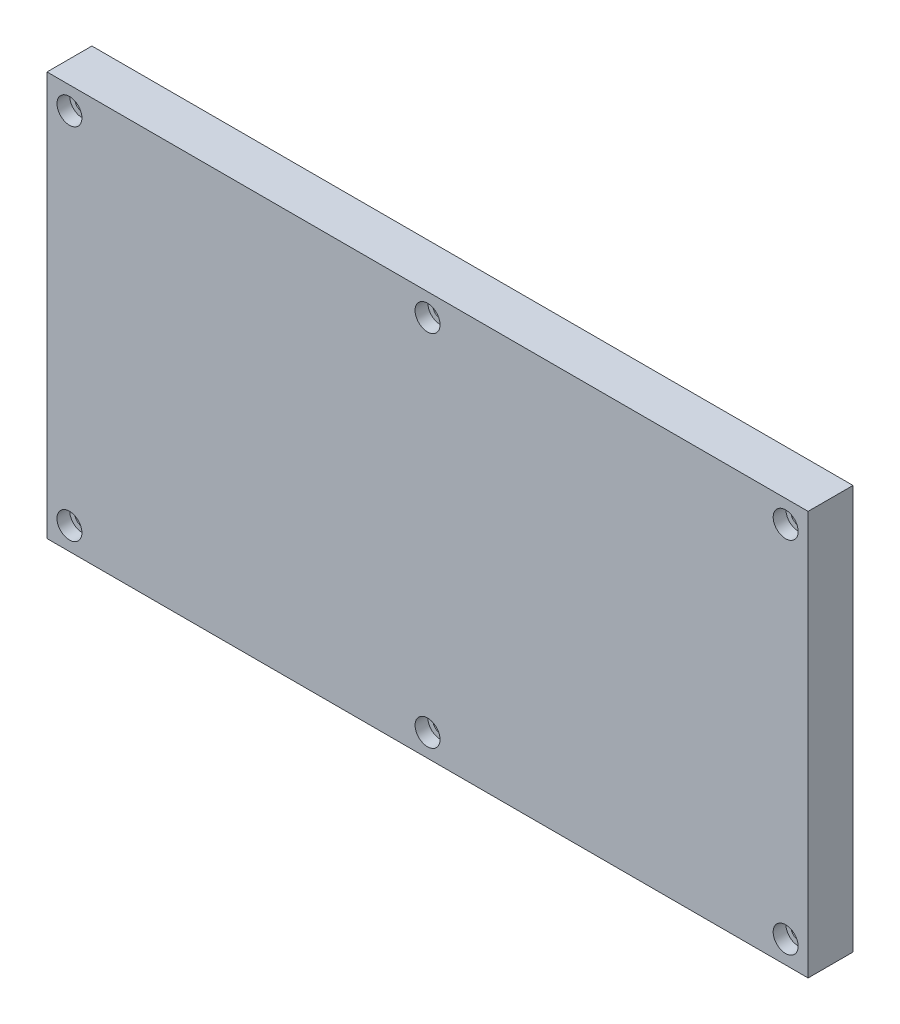
ISO-10303-21;
HEADER;
FILE_DESCRIPTION(('STEP AP214'),'2;1');
FILE_NAME('part.step','',(''),(''),'','','');
FILE_SCHEMA(('AUTOMOTIVE_DESIGN { 1 0 10303 214 1 1 1 1 }'));
ENDSEC;
DATA;
#1=APPLICATION_CONTEXT('core data for automotive mechanical design processes');
#2=APPLICATION_PROTOCOL_DEFINITION('international standard','automotive_design',2000,#1);
#3=PRODUCT_CONTEXT('',#1,'mechanical');
#4=PRODUCT('Part','Part','',(#3));
#5=PRODUCT_RELATED_PRODUCT_CATEGORY('part','',(#4));
#6=PRODUCT_DEFINITION_FORMATION('','',#4);
#7=PRODUCT_DEFINITION_CONTEXT('part definition',#1,'design');
#8=PRODUCT_DEFINITION('design','',#6,#7);
#9=PRODUCT_DEFINITION_SHAPE('','',#8);
#10=(LENGTH_UNIT() NAMED_UNIT(*) SI_UNIT(.MILLI.,.METRE.));
#11=(NAMED_UNIT(*) PLANE_ANGLE_UNIT() SI_UNIT($,.RADIAN.));
#12=(NAMED_UNIT(*) SI_UNIT($,.STERADIAN.) SOLID_ANGLE_UNIT());
#13=UNCERTAINTY_MEASURE_WITH_UNIT(LENGTH_MEASURE(1.E-05),#10,'distance_accuracy_value','');
#14=(GEOMETRIC_REPRESENTATION_CONTEXT(3) GLOBAL_UNCERTAINTY_ASSIGNED_CONTEXT((#13)) GLOBAL_UNIT_ASSIGNED_CONTEXT((#10,
#11,#12)) REPRESENTATION_CONTEXT('',''));
#15=CARTESIAN_POINT('',(0.,0.,0.));
#16=DIRECTION('',(0.,0.,1.));
#17=DIRECTION('',(1.,0.,0.));
#18=AXIS2_PLACEMENT_3D('',#15,#16,#17);
#19=CARTESIAN_POINT('',(0.,0.,10.));
#20=DIRECTION('',(1.,0.,0.));
#21=DIRECTION('',(0.,0.,-1.));
#22=AXIS2_PLACEMENT_3D('',#19,#20,#21);
#23=PLANE('',#22);
#24=DIRECTION('',(0.,-1.,0.));
#25=VECTOR('',#24,1.);
#26=CARTESIAN_POINT('',(0.,0.,0.));
#27=LINE('',#26,#25);
#28=CARTESIAN_POINT('',(0.,90.,0.));
#29=VERTEX_POINT('',#28);
#30=CARTESIAN_POINT('',(0.,0.,0.));
#31=VERTEX_POINT('',#30);
#32=EDGE_CURVE('E95',#29,#31,#27,.T.);
#33=ORIENTED_EDGE('',*,*,#32,.T.);
#34=DIRECTION('',(0.,0.,-1.));
#35=VECTOR('',#34,1.);
#36=CARTESIAN_POINT('',(0.,0.,10.));
#37=LINE('',#36,#35);
#38=CARTESIAN_POINT('',(0.,0.,10.));
#39=VERTEX_POINT('',#38);
#40=EDGE_CURVE('E11',#39,#31,#37,.T.);
#41=ORIENTED_EDGE('',*,*,#40,.F.);
#42=DIRECTION('',(0.,-1.,0.));
#43=VECTOR('',#42,1.);
#44=CARTESIAN_POINT('',(0.,0.,10.));
#45=LINE('',#44,#43);
#46=CARTESIAN_POINT('',(0.,90.,10.));
#47=VERTEX_POINT('',#46);
#48=EDGE_CURVE('E83',#47,#39,#45,.T.);
#49=ORIENTED_EDGE('',*,*,#48,.F.);
#50=DIRECTION('',(0.,0.,-1.));
#51=VECTOR('',#50,1.);
#52=CARTESIAN_POINT('',(0.,90.,10.));
#53=LINE('',#52,#51);
#54=EDGE_CURVE('E91',#47,#29,#53,.T.);
#55=ORIENTED_EDGE('',*,*,#54,.T.);
#56=EDGE_LOOP('',(#33,#41,#49,#55));
#57=FACE_BOUND('',#56,.T.);
#58=ADVANCED_FACE('F32',(#57),#23,.F.);
#59=CARTESIAN_POINT('',(0.,0.,10.));
#60=DIRECTION('',(0.,1.,0.));
#61=DIRECTION('',(0.,0.,1.));
#62=AXIS2_PLACEMENT_3D('',#59,#60,#61);
#63=PLANE('',#62);
#64=DIRECTION('',(1.,0.,0.));
#65=VECTOR('',#64,1.);
#66=CARTESIAN_POINT('',(0.,0.,0.));
#67=LINE('',#66,#65);
#68=CARTESIAN_POINT('',(169.5,0.,0.));
#69=VERTEX_POINT('',#68);
#70=EDGE_CURVE('E87',#31,#69,#67,.T.);
#71=ORIENTED_EDGE('',*,*,#70,.T.);
#72=DIRECTION('',(0.,0.,-1.));
#73=VECTOR('',#72,1.);
#74=CARTESIAN_POINT('',(169.5,0.,10.));
#75=LINE('',#74,#73);
#76=CARTESIAN_POINT('',(169.5,0.,10.));
#77=VERTEX_POINT('',#76);
#78=EDGE_CURVE('E40',#77,#69,#75,.T.);
#79=ORIENTED_EDGE('',*,*,#78,.F.);
#80=DIRECTION('',(1.,0.,0.));
#81=VECTOR('',#80,1.);
#82=CARTESIAN_POINT('',(0.,0.,10.));
#83=LINE('',#82,#81);
#84=EDGE_CURVE('E78',#39,#77,#83,.T.);
#85=ORIENTED_EDGE('',*,*,#84,.F.);
#86=ORIENTED_EDGE('',*,*,#40,.T.);
#87=EDGE_LOOP('',(#71,#79,#85,#86));
#88=FACE_BOUND('',#87,.T.);
#89=ADVANCED_FACE('F86',(#88),#63,.F.);
#90=CARTESIAN_POINT('',(169.5,0.,10.));
#91=DIRECTION('',(-1.,0.,0.));
#92=DIRECTION('',(0.,0.,1.));
#93=AXIS2_PLACEMENT_3D('',#90,#91,#92);
#94=PLANE('',#93);
#95=DIRECTION('',(0.,1.,0.));
#96=VECTOR('',#95,1.);
#97=CARTESIAN_POINT('',(169.5,0.,0.));
#98=LINE('',#97,#96);
#99=CARTESIAN_POINT('',(169.5,90.,0.));
#100=VERTEX_POINT('',#99);
#101=EDGE_CURVE('E65',#69,#100,#98,.T.);
#102=ORIENTED_EDGE('',*,*,#101,.T.);
#103=DIRECTION('',(0.,0.,-1.));
#104=VECTOR('',#103,1.);
#105=CARTESIAN_POINT('',(169.5,90.,10.));
#106=LINE('',#105,#104);
#107=CARTESIAN_POINT('',(169.5,90.,10.));
#108=VERTEX_POINT('',#107);
#109=EDGE_CURVE('E88',#108,#100,#106,.T.);
#110=ORIENTED_EDGE('',*,*,#109,.F.);
#111=DIRECTION('',(0.,1.,0.));
#112=VECTOR('',#111,1.);
#113=CARTESIAN_POINT('',(169.5,0.,10.));
#114=LINE('',#113,#112);
#115=EDGE_CURVE('E81',#77,#108,#114,.T.);
#116=ORIENTED_EDGE('',*,*,#115,.F.);
#117=ORIENTED_EDGE('',*,*,#78,.T.);
#118=EDGE_LOOP('',(#102,#110,#116,#117));
#119=FACE_BOUND('',#118,.T.);
#120=ADVANCED_FACE('F89',(#119),#94,.F.);
#121=CARTESIAN_POINT('',(0.,90.,10.));
#122=DIRECTION('',(0.,-1.,0.));
#123=DIRECTION('',(0.,0.,-1.));
#124=AXIS2_PLACEMENT_3D('',#121,#122,#123);
#125=PLANE('',#124);
#126=DIRECTION('',(-1.,0.,0.));
#127=VECTOR('',#126,1.);
#128=CARTESIAN_POINT('',(0.,90.,0.));
#129=LINE('',#128,#127);
#130=EDGE_CURVE('E71',#100,#29,#129,.T.);
#131=ORIENTED_EDGE('',*,*,#130,.T.);
#132=ORIENTED_EDGE('',*,*,#54,.F.);
#133=DIRECTION('',(-1.,0.,0.));
#134=VECTOR('',#133,1.);
#135=CARTESIAN_POINT('',(0.,90.,10.));
#136=LINE('',#135,#134);
#137=EDGE_CURVE('E48',#108,#47,#136,.T.);
#138=ORIENTED_EDGE('',*,*,#137,.F.);
#139=ORIENTED_EDGE('',*,*,#109,.T.);
#140=EDGE_LOOP('',(#131,#132,#138,#139));
#141=FACE_BOUND('',#140,.T.);
#142=ADVANCED_FACE('F103',(#141),#125,.F.);
#143=CARTESIAN_POINT('',(0.,0.,10.));
#144=DIRECTION('',(0.,0.,-1.));
#145=DIRECTION('',(-1.,0.,0.));
#146=AXIS2_PLACEMENT_3D('',#143,#144,#145);
#147=PLANE('',#146);
#148=CARTESIAN_POINT('',(5.,85.,10.));
#149=DIRECTION('',(0.,0.,1.));
#150=DIRECTION('',(1.,0.,0.));
#151=AXIS2_PLACEMENT_3D('',#148,#149,#150);
#152=CIRCLE('',#151,2.77876);
#153=CARTESIAN_POINT('',(7.77876,85.,10.));
#154=VERTEX_POINT('',#153);
#155=EDGE_CURVE('E177',#154,#154,#152,.T.);
#156=ORIENTED_EDGE('',*,*,#155,.F.);
#157=EDGE_LOOP('',(#156));
#158=FACE_BOUND('',#157,.T.);
#159=CARTESIAN_POINT('',(164.5,85.,10.));
#160=DIRECTION('',(0.,0.,1.));
#161=DIRECTION('',(1.,0.,0.));
#162=AXIS2_PLACEMENT_3D('',#159,#160,#161);
#163=CIRCLE('',#162,2.77875999999999);
#164=CARTESIAN_POINT('',(167.27876,85.,10.));
#165=VERTEX_POINT('',#164);
#166=EDGE_CURVE('E165',#165,#165,#163,.T.);
#167=ORIENTED_EDGE('',*,*,#166,.F.);
#168=EDGE_LOOP('',(#167));
#169=FACE_BOUND('',#168,.T.);
#170=CARTESIAN_POINT('',(164.5,5.,10.));
#171=DIRECTION('',(0.,0.,1.));
#172=DIRECTION('',(1.,0.,0.));
#173=AXIS2_PLACEMENT_3D('',#170,#171,#172);
#174=CIRCLE('',#173,2.77875999999999);
#175=CARTESIAN_POINT('',(167.27876,5.,10.));
#176=VERTEX_POINT('',#175);
#177=EDGE_CURVE('E153',#176,#176,#174,.T.);
#178=ORIENTED_EDGE('',*,*,#177,.F.);
#179=EDGE_LOOP('',(#178));
#180=FACE_BOUND('',#179,.T.);
#181=CARTESIAN_POINT('',(5.,5.,10.));
#182=DIRECTION('',(0.,0.,1.));
#183=DIRECTION('',(1.,0.,0.));
#184=AXIS2_PLACEMENT_3D('',#181,#182,#183);
#185=CIRCLE('',#184,2.77876);
#186=CARTESIAN_POINT('',(7.77876,5.,10.));
#187=VERTEX_POINT('',#186);
#188=EDGE_CURVE('E141',#187,#187,#185,.T.);
#189=ORIENTED_EDGE('',*,*,#188,.F.);
#190=EDGE_LOOP('',(#189));
#191=FACE_BOUND('',#190,.T.);
#192=CARTESIAN_POINT('',(84.75,5.,10.));
#193=DIRECTION('',(0.,0.,1.));
#194=DIRECTION('',(1.,0.,0.));
#195=AXIS2_PLACEMENT_3D('',#192,#193,#194);
#196=CIRCLE('',#195,2.77876000000001);
#197=CARTESIAN_POINT('',(87.52876,5.,10.));
#198=VERTEX_POINT('',#197);
#199=EDGE_CURVE('E129',#198,#198,#196,.T.);
#200=ORIENTED_EDGE('',*,*,#199,.F.);
#201=EDGE_LOOP('',(#200));
#202=FACE_BOUND('',#201,.T.);
#203=CARTESIAN_POINT('',(84.75,85.,10.));
#204=DIRECTION('',(0.,0.,1.));
#205=DIRECTION('',(1.,0.,0.));
#206=AXIS2_PLACEMENT_3D('',#203,#204,#205);
#207=CIRCLE('',#206,2.77876000000001);
#208=CARTESIAN_POINT('',(87.52876,85.,10.));
#209=VERTEX_POINT('',#208);
#210=EDGE_CURVE('E117',#209,#209,#207,.T.);
#211=ORIENTED_EDGE('',*,*,#210,.F.);
#212=EDGE_LOOP('',(#211));
#213=FACE_BOUND('',#212,.T.);
#214=ORIENTED_EDGE('',*,*,#48,.T.);
#215=ORIENTED_EDGE('',*,*,#84,.T.);
#216=ORIENTED_EDGE('',*,*,#115,.T.);
#217=ORIENTED_EDGE('',*,*,#137,.T.);
#218=EDGE_LOOP('',(#214,#215,#216,#217));
#219=FACE_BOUND('',#218,.T.);
#220=ADVANCED_FACE('F79',(#158,#169,#180,#191,#202,#213,#219),#147,.F.);
#221=CARTESIAN_POINT('',(0.,0.,0.));
#222=DIRECTION('',(0.,0.,-1.));
#223=DIRECTION('',(-1.,0.,0.));
#224=AXIS2_PLACEMENT_3D('',#221,#222,#223);
#225=PLANE('',#224);
#226=CARTESIAN_POINT('',(5.,85.,0.));
#227=DIRECTION('',(0.,0.,1.));
#228=DIRECTION('',(1.,0.,0.));
#229=AXIS2_PLACEMENT_3D('',#226,#227,#228);
#230=CIRCLE('',#229,1.63195);
#231=CARTESIAN_POINT('',(6.63195,85.,0.));
#232=VERTEX_POINT('',#231);
#233=EDGE_CURVE('E168',#232,#232,#230,.T.);
#234=ORIENTED_EDGE('',*,*,#233,.T.);
#235=EDGE_LOOP('',(#234));
#236=FACE_BOUND('',#235,.T.);
#237=CARTESIAN_POINT('',(164.5,85.,0.));
#238=DIRECTION('',(0.,0.,1.));
#239=DIRECTION('',(1.,0.,0.));
#240=AXIS2_PLACEMENT_3D('',#237,#238,#239);
#241=CIRCLE('',#240,1.63194999999999);
#242=CARTESIAN_POINT('',(166.13195,85.,0.));
#243=VERTEX_POINT('',#242);
#244=EDGE_CURVE('E156',#243,#243,#241,.T.);
#245=ORIENTED_EDGE('',*,*,#244,.T.);
#246=EDGE_LOOP('',(#245));
#247=FACE_BOUND('',#246,.T.);
#248=CARTESIAN_POINT('',(164.5,5.,0.));
#249=DIRECTION('',(0.,0.,1.));
#250=DIRECTION('',(1.,0.,0.));
#251=AXIS2_PLACEMENT_3D('',#248,#249,#250);
#252=CIRCLE('',#251,1.63194999999999);
#253=CARTESIAN_POINT('',(166.13195,5.,0.));
#254=VERTEX_POINT('',#253);
#255=EDGE_CURVE('E144',#254,#254,#252,.T.);
#256=ORIENTED_EDGE('',*,*,#255,.T.);
#257=EDGE_LOOP('',(#256));
#258=FACE_BOUND('',#257,.T.);
#259=CARTESIAN_POINT('',(5.,5.,0.));
#260=DIRECTION('',(0.,0.,1.));
#261=DIRECTION('',(1.,0.,0.));
#262=AXIS2_PLACEMENT_3D('',#259,#260,#261);
#263=CIRCLE('',#262,1.63195);
#264=CARTESIAN_POINT('',(6.63195,5.,0.));
#265=VERTEX_POINT('',#264);
#266=EDGE_CURVE('E132',#265,#265,#263,.T.);
#267=ORIENTED_EDGE('',*,*,#266,.T.);
#268=EDGE_LOOP('',(#267));
#269=FACE_BOUND('',#268,.T.);
#270=CARTESIAN_POINT('',(84.75,5.,0.));
#271=DIRECTION('',(0.,0.,1.));
#272=DIRECTION('',(1.,0.,0.));
#273=AXIS2_PLACEMENT_3D('',#270,#271,#272);
#274=CIRCLE('',#273,1.63194999999999);
#275=CARTESIAN_POINT('',(86.38195,5.,0.));
#276=VERTEX_POINT('',#275);
#277=EDGE_CURVE('E120',#276,#276,#274,.T.);
#278=ORIENTED_EDGE('',*,*,#277,.T.);
#279=EDGE_LOOP('',(#278));
#280=FACE_BOUND('',#279,.T.);
#281=CARTESIAN_POINT('',(84.75,85.,0.));
#282=DIRECTION('',(0.,0.,1.));
#283=DIRECTION('',(1.,0.,0.));
#284=AXIS2_PLACEMENT_3D('',#281,#282,#283);
#285=CIRCLE('',#284,1.63194999999999);
#286=CARTESIAN_POINT('',(86.38195,85.,0.));
#287=VERTEX_POINT('',#286);
#288=EDGE_CURVE('E98',#287,#287,#285,.T.);
#289=ORIENTED_EDGE('',*,*,#288,.T.);
#290=EDGE_LOOP('',(#289));
#291=FACE_BOUND('',#290,.T.);
#292=ORIENTED_EDGE('',*,*,#32,.F.);
#293=ORIENTED_EDGE('',*,*,#130,.F.);
#294=ORIENTED_EDGE('',*,*,#101,.F.);
#295=ORIENTED_EDGE('',*,*,#70,.F.);
#296=EDGE_LOOP('',(#292,#293,#294,#295));
#297=FACE_BOUND('',#296,.T.);
#298=ADVANCED_FACE('F106',(#236,#247,#258,#269,#280,#291,#297),#225,.T.);
#299=CARTESIAN_POINT('',(84.75,85.,10.));
#300=DIRECTION('',(0.,0.,1.));
#301=DIRECTION('',(1.,0.,0.));
#302=AXIS2_PLACEMENT_3D('',#299,#300,#301);
#303=CYLINDRICAL_SURFACE('',#302,1.63195);
#304=ORIENTED_EDGE('',*,*,#288,.F.);
#305=EDGE_LOOP('',(#304));
#306=FACE_BOUND('',#305,.T.);
#307=CARTESIAN_POINT('',(84.75,85.,7.1552));
#308=DIRECTION('',(0.,0.,1.));
#309=DIRECTION('',(1.,0.,0.));
#310=AXIS2_PLACEMENT_3D('',#307,#308,#309);
#311=CIRCLE('',#310,1.63195000000001);
#312=CARTESIAN_POINT('',(86.38195,85.,7.1552));
#313=VERTEX_POINT('',#312);
#314=EDGE_CURVE('E111',#313,#313,#311,.T.);
#315=ORIENTED_EDGE('',*,*,#314,.T.);
#316=EDGE_LOOP('',(#315));
#317=FACE_BOUND('',#316,.T.);
#318=ADVANCED_FACE('F209',(#306,#317),#303,.F.);
#319=CARTESIAN_POINT('',(86.38195,85.,7.1552));
#320=DIRECTION('',(0.,0.,-1.));
#321=DIRECTION('',(-1.,0.,0.));
#322=AXIS2_PLACEMENT_3D('',#319,#320,#321);
#323=PLANE('',#322);
#324=ORIENTED_EDGE('',*,*,#314,.F.);
#325=EDGE_LOOP('',(#324));
#326=FACE_BOUND('',#325,.T.);
#327=CARTESIAN_POINT('',(84.75,85.,7.1552));
#328=DIRECTION('',(0.,0.,1.));
#329=DIRECTION('',(1.,0.,0.));
#330=AXIS2_PLACEMENT_3D('',#327,#328,#329);
#331=CIRCLE('',#330,2.77876000000001);
#332=CARTESIAN_POINT('',(87.52876,85.,7.1552));
#333=VERTEX_POINT('',#332);
#334=EDGE_CURVE('E114',#333,#333,#331,.T.);
#335=ORIENTED_EDGE('',*,*,#334,.T.);
#336=EDGE_LOOP('',(#335));
#337=FACE_BOUND('',#336,.T.);
#338=ADVANCED_FACE('F199',(#326,#337),#323,.F.);
#339=CARTESIAN_POINT('',(84.75,85.,10.));
#340=DIRECTION('',(0.,0.,1.));
#341=DIRECTION('',(1.,0.,0.));
#342=AXIS2_PLACEMENT_3D('',#339,#340,#341);
#343=CYLINDRICAL_SURFACE('',#342,2.77876000000001);
#344=ORIENTED_EDGE('',*,*,#334,.F.);
#345=EDGE_LOOP('',(#344));
#346=FACE_BOUND('',#345,.T.);
#347=ORIENTED_EDGE('',*,*,#210,.T.);
#348=EDGE_LOOP('',(#347));
#349=FACE_BOUND('',#348,.T.);
#350=ADVANCED_FACE('F196',(#346,#349),#343,.F.);
#351=CARTESIAN_POINT('',(84.75,5.,10.));
#352=DIRECTION('',(0.,0.,1.));
#353=DIRECTION('',(1.,0.,0.));
#354=AXIS2_PLACEMENT_3D('',#351,#352,#353);
#355=CYLINDRICAL_SURFACE('',#354,1.63195);
#356=ORIENTED_EDGE('',*,*,#277,.F.);
#357=EDGE_LOOP('',(#356));
#358=FACE_BOUND('',#357,.T.);
#359=CARTESIAN_POINT('',(84.75,5.,7.1552));
#360=DIRECTION('',(0.,0.,1.));
#361=DIRECTION('',(1.,0.,0.));
#362=AXIS2_PLACEMENT_3D('',#359,#360,#361);
#363=CIRCLE('',#362,1.63195000000001);
#364=CARTESIAN_POINT('',(86.38195,5.,7.1552));
#365=VERTEX_POINT('',#364);
#366=EDGE_CURVE('E123',#365,#365,#363,.T.);
#367=ORIENTED_EDGE('',*,*,#366,.T.);
#368=EDGE_LOOP('',(#367));
#369=FACE_BOUND('',#368,.T.);
#370=ADVANCED_FACE('F198',(#358,#369),#355,.F.);
#371=CARTESIAN_POINT('',(86.38195,5.,7.1552));
#372=DIRECTION('',(0.,0.,-1.));
#373=DIRECTION('',(-1.,0.,0.));
#374=AXIS2_PLACEMENT_3D('',#371,#372,#373);
#375=PLANE('',#374);
#376=ORIENTED_EDGE('',*,*,#366,.F.);
#377=EDGE_LOOP('',(#376));
#378=FACE_BOUND('',#377,.T.);
#379=CARTESIAN_POINT('',(84.75,5.,7.1552));
#380=DIRECTION('',(0.,0.,1.));
#381=DIRECTION('',(1.,0.,0.));
#382=AXIS2_PLACEMENT_3D('',#379,#380,#381);
#383=CIRCLE('',#382,2.77876000000001);
#384=CARTESIAN_POINT('',(87.52876,5.,7.1552));
#385=VERTEX_POINT('',#384);
#386=EDGE_CURVE('E126',#385,#385,#383,.T.);
#387=ORIENTED_EDGE('',*,*,#386,.T.);
#388=EDGE_LOOP('',(#387));
#389=FACE_BOUND('',#388,.T.);
#390=ADVANCED_FACE('F206',(#378,#389),#375,.F.);
#391=CARTESIAN_POINT('',(84.75,5.,10.));
#392=DIRECTION('',(0.,0.,1.));
#393=DIRECTION('',(1.,0.,0.));
#394=AXIS2_PLACEMENT_3D('',#391,#392,#393);
#395=CYLINDRICAL_SURFACE('',#394,2.77876000000001);
#396=ORIENTED_EDGE('',*,*,#386,.F.);
#397=EDGE_LOOP('',(#396));
#398=FACE_BOUND('',#397,.T.);
#399=ORIENTED_EDGE('',*,*,#199,.T.);
#400=EDGE_LOOP('',(#399));
#401=FACE_BOUND('',#400,.T.);
#402=ADVANCED_FACE('F261',(#398,#401),#395,.F.);
#403=CARTESIAN_POINT('',(5.,5.,10.));
#404=DIRECTION('',(0.,0.,1.));
#405=DIRECTION('',(1.,0.,0.));
#406=AXIS2_PLACEMENT_3D('',#403,#404,#405);
#407=CYLINDRICAL_SURFACE('',#406,1.63195);
#408=ORIENTED_EDGE('',*,*,#266,.F.);
#409=EDGE_LOOP('',(#408));
#410=FACE_BOUND('',#409,.T.);
#411=CARTESIAN_POINT('',(5.,5.,7.1552));
#412=DIRECTION('',(0.,0.,1.));
#413=DIRECTION('',(1.,0.,0.));
#414=AXIS2_PLACEMENT_3D('',#411,#412,#413);
#415=CIRCLE('',#414,1.63195);
#416=CARTESIAN_POINT('',(6.63195,5.,7.1552));
#417=VERTEX_POINT('',#416);
#418=EDGE_CURVE('E135',#417,#417,#415,.T.);
#419=ORIENTED_EDGE('',*,*,#418,.T.);
#420=EDGE_LOOP('',(#419));
#421=FACE_BOUND('',#420,.T.);
#422=ADVANCED_FACE('F271',(#410,#421),#407,.F.);
#423=CARTESIAN_POINT('',(6.63195,5.,7.1552));
#424=DIRECTION('',(0.,0.,-1.));
#425=DIRECTION('',(-1.,0.,0.));
#426=AXIS2_PLACEMENT_3D('',#423,#424,#425);
#427=PLANE('',#426);
#428=ORIENTED_EDGE('',*,*,#418,.F.);
#429=EDGE_LOOP('',(#428));
#430=FACE_BOUND('',#429,.T.);
#431=CARTESIAN_POINT('',(5.,5.,7.1552));
#432=DIRECTION('',(0.,0.,1.));
#433=DIRECTION('',(1.,0.,0.));
#434=AXIS2_PLACEMENT_3D('',#431,#432,#433);
#435=CIRCLE('',#434,2.77876);
#436=CARTESIAN_POINT('',(7.77876,5.,7.1552));
#437=VERTEX_POINT('',#436);
#438=EDGE_CURVE('E138',#437,#437,#435,.T.);
#439=ORIENTED_EDGE('',*,*,#438,.T.);
#440=EDGE_LOOP('',(#439));
#441=FACE_BOUND('',#440,.T.);
#442=ADVANCED_FACE('F281',(#430,#441),#427,.F.);
#443=CARTESIAN_POINT('',(5.,5.,10.));
#444=DIRECTION('',(0.,0.,1.));
#445=DIRECTION('',(1.,0.,0.));
#446=AXIS2_PLACEMENT_3D('',#443,#444,#445);
#447=CYLINDRICAL_SURFACE('',#446,2.77876);
#448=ORIENTED_EDGE('',*,*,#438,.F.);
#449=EDGE_LOOP('',(#448));
#450=FACE_BOUND('',#449,.T.);
#451=ORIENTED_EDGE('',*,*,#188,.T.);
#452=EDGE_LOOP('',(#451));
#453=FACE_BOUND('',#452,.T.);
#454=ADVANCED_FACE('F291',(#450,#453),#447,.F.);
#455=CARTESIAN_POINT('',(164.5,5.,10.));
#456=DIRECTION('',(0.,0.,1.));
#457=DIRECTION('',(1.,0.,0.));
#458=AXIS2_PLACEMENT_3D('',#455,#456,#457);
#459=CYLINDRICAL_SURFACE('',#458,1.63194999999999);
#460=ORIENTED_EDGE('',*,*,#255,.F.);
#461=EDGE_LOOP('',(#460));
#462=FACE_BOUND('',#461,.T.);
#463=CARTESIAN_POINT('',(164.5,5.,7.1552));
#464=DIRECTION('',(0.,0.,1.));
#465=DIRECTION('',(1.,0.,0.));
#466=AXIS2_PLACEMENT_3D('',#463,#464,#465);
#467=CIRCLE('',#466,1.63194999999999);
#468=CARTESIAN_POINT('',(166.13195,5.,7.1552));
#469=VERTEX_POINT('',#468);
#470=EDGE_CURVE('E147',#469,#469,#467,.T.);
#471=ORIENTED_EDGE('',*,*,#470,.T.);
#472=EDGE_LOOP('',(#471));
#473=FACE_BOUND('',#472,.T.);
#474=ADVANCED_FACE('F301',(#462,#473),#459,.F.);
#475=CARTESIAN_POINT('',(166.13195,5.,7.1552));
#476=DIRECTION('',(0.,0.,-1.));
#477=DIRECTION('',(-1.,0.,0.));
#478=AXIS2_PLACEMENT_3D('',#475,#476,#477);
#479=PLANE('',#478);
#480=ORIENTED_EDGE('',*,*,#470,.F.);
#481=EDGE_LOOP('',(#480));
#482=FACE_BOUND('',#481,.T.);
#483=CARTESIAN_POINT('',(164.5,5.,7.1552));
#484=DIRECTION('',(0.,0.,1.));
#485=DIRECTION('',(1.,0.,0.));
#486=AXIS2_PLACEMENT_3D('',#483,#484,#485);
#487=CIRCLE('',#486,2.77875999999999);
#488=CARTESIAN_POINT('',(167.27876,5.,7.1552));
#489=VERTEX_POINT('',#488);
#490=EDGE_CURVE('E150',#489,#489,#487,.T.);
#491=ORIENTED_EDGE('',*,*,#490,.T.);
#492=EDGE_LOOP('',(#491));
#493=FACE_BOUND('',#492,.T.);
#494=ADVANCED_FACE('F311',(#482,#493),#479,.F.);
#495=CARTESIAN_POINT('',(164.5,5.,10.));
#496=DIRECTION('',(0.,0.,1.));
#497=DIRECTION('',(1.,0.,0.));
#498=AXIS2_PLACEMENT_3D('',#495,#496,#497);
#499=CYLINDRICAL_SURFACE('',#498,2.77875999999999);
#500=ORIENTED_EDGE('',*,*,#490,.F.);
#501=EDGE_LOOP('',(#500));
#502=FACE_BOUND('',#501,.T.);
#503=ORIENTED_EDGE('',*,*,#177,.T.);
#504=EDGE_LOOP('',(#503));
#505=FACE_BOUND('',#504,.T.);
#506=ADVANCED_FACE('F321',(#502,#505),#499,.F.);
#507=CARTESIAN_POINT('',(164.5,85.,10.));
#508=DIRECTION('',(0.,0.,1.));
#509=DIRECTION('',(1.,0.,0.));
#510=AXIS2_PLACEMENT_3D('',#507,#508,#509);
#511=CYLINDRICAL_SURFACE('',#510,1.63194999999999);
#512=ORIENTED_EDGE('',*,*,#244,.F.);
#513=EDGE_LOOP('',(#512));
#514=FACE_BOUND('',#513,.T.);
#515=CARTESIAN_POINT('',(164.5,85.,7.1552));
#516=DIRECTION('',(0.,0.,1.));
#517=DIRECTION('',(1.,0.,0.));
#518=AXIS2_PLACEMENT_3D('',#515,#516,#517);
#519=CIRCLE('',#518,1.63194999999999);
#520=CARTESIAN_POINT('',(166.13195,85.,7.1552));
#521=VERTEX_POINT('',#520);
#522=EDGE_CURVE('E159',#521,#521,#519,.T.);
#523=ORIENTED_EDGE('',*,*,#522,.T.);
#524=EDGE_LOOP('',(#523));
#525=FACE_BOUND('',#524,.T.);
#526=ADVANCED_FACE('F331',(#514,#525),#511,.F.);
#527=CARTESIAN_POINT('',(166.13195,85.,7.1552));
#528=DIRECTION('',(0.,0.,-1.));
#529=DIRECTION('',(-1.,0.,0.));
#530=AXIS2_PLACEMENT_3D('',#527,#528,#529);
#531=PLANE('',#530);
#532=ORIENTED_EDGE('',*,*,#522,.F.);
#533=EDGE_LOOP('',(#532));
#534=FACE_BOUND('',#533,.T.);
#535=CARTESIAN_POINT('',(164.5,85.,7.1552));
#536=DIRECTION('',(0.,0.,1.));
#537=DIRECTION('',(1.,0.,0.));
#538=AXIS2_PLACEMENT_3D('',#535,#536,#537);
#539=CIRCLE('',#538,2.77875999999999);
#540=CARTESIAN_POINT('',(167.27876,85.,7.1552));
#541=VERTEX_POINT('',#540);
#542=EDGE_CURVE('E162',#541,#541,#539,.T.);
#543=ORIENTED_EDGE('',*,*,#542,.T.);
#544=EDGE_LOOP('',(#543));
#545=FACE_BOUND('',#544,.T.);
#546=ADVANCED_FACE('F341',(#534,#545),#531,.F.);
#547=CARTESIAN_POINT('',(164.5,85.,10.));
#548=DIRECTION('',(0.,0.,1.));
#549=DIRECTION('',(1.,0.,0.));
#550=AXIS2_PLACEMENT_3D('',#547,#548,#549);
#551=CYLINDRICAL_SURFACE('',#550,2.77875999999999);
#552=ORIENTED_EDGE('',*,*,#542,.F.);
#553=EDGE_LOOP('',(#552));
#554=FACE_BOUND('',#553,.T.);
#555=ORIENTED_EDGE('',*,*,#166,.T.);
#556=EDGE_LOOP('',(#555));
#557=FACE_BOUND('',#556,.T.);
#558=ADVANCED_FACE('F351',(#554,#557),#551,.F.);
#559=CARTESIAN_POINT('',(5.,85.,10.));
#560=DIRECTION('',(0.,0.,1.));
#561=DIRECTION('',(1.,0.,0.));
#562=AXIS2_PLACEMENT_3D('',#559,#560,#561);
#563=CYLINDRICAL_SURFACE('',#562,1.63195);
#564=ORIENTED_EDGE('',*,*,#233,.F.);
#565=EDGE_LOOP('',(#564));
#566=FACE_BOUND('',#565,.T.);
#567=CARTESIAN_POINT('',(5.,85.,7.1552));
#568=DIRECTION('',(0.,0.,1.));
#569=DIRECTION('',(1.,0.,0.));
#570=AXIS2_PLACEMENT_3D('',#567,#568,#569);
#571=CIRCLE('',#570,1.63195);
#572=CARTESIAN_POINT('',(6.63195,85.,7.1552));
#573=VERTEX_POINT('',#572);
#574=EDGE_CURVE('E171',#573,#573,#571,.T.);
#575=ORIENTED_EDGE('',*,*,#574,.T.);
#576=EDGE_LOOP('',(#575));
#577=FACE_BOUND('',#576,.T.);
#578=ADVANCED_FACE('F361',(#566,#577),#563,.F.);
#579=CARTESIAN_POINT('',(6.63195,85.,7.1552));
#580=DIRECTION('',(0.,0.,-1.));
#581=DIRECTION('',(-1.,0.,0.));
#582=AXIS2_PLACEMENT_3D('',#579,#580,#581);
#583=PLANE('',#582);
#584=ORIENTED_EDGE('',*,*,#574,.F.);
#585=EDGE_LOOP('',(#584));
#586=FACE_BOUND('',#585,.T.);
#587=CARTESIAN_POINT('',(5.,85.,7.1552));
#588=DIRECTION('',(0.,0.,1.));
#589=DIRECTION('',(1.,0.,0.));
#590=AXIS2_PLACEMENT_3D('',#587,#588,#589);
#591=CIRCLE('',#590,2.77876);
#592=CARTESIAN_POINT('',(7.77876,85.,7.1552));
#593=VERTEX_POINT('',#592);
#594=EDGE_CURVE('E174',#593,#593,#591,.T.);
#595=ORIENTED_EDGE('',*,*,#594,.T.);
#596=EDGE_LOOP('',(#595));
#597=FACE_BOUND('',#596,.T.);
#598=ADVANCED_FACE('F371',(#586,#597),#583,.F.);
#599=CARTESIAN_POINT('',(5.,85.,10.));
#600=DIRECTION('',(0.,0.,1.));
#601=DIRECTION('',(1.,0.,0.));
#602=AXIS2_PLACEMENT_3D('',#599,#600,#601);
#603=CYLINDRICAL_SURFACE('',#602,2.77876);
#604=ORIENTED_EDGE('',*,*,#594,.F.);
#605=EDGE_LOOP('',(#604));
#606=FACE_BOUND('',#605,.T.);
#607=ORIENTED_EDGE('',*,*,#155,.T.);
#608=EDGE_LOOP('',(#607));
#609=FACE_BOUND('',#608,.T.);
#610=ADVANCED_FACE('F181',(#606,#609),#603,.F.);
#611=CLOSED_SHELL('',(#58,#89,#120,#142,#220,#298,#318,#338,#350,#370,#390,#402,#422,#442,#454,
#474,#494,#506,#526,#546,#558,#578,#598,#610));
#612=MANIFOLD_SOLID_BREP('B2',#611);
#613=ADVANCED_BREP_SHAPE_REPRESENTATION('',(#18,#612),#14);
#614=SHAPE_DEFINITION_REPRESENTATION(#9,#613);
ENDSEC;
END-ISO-10303-21;
